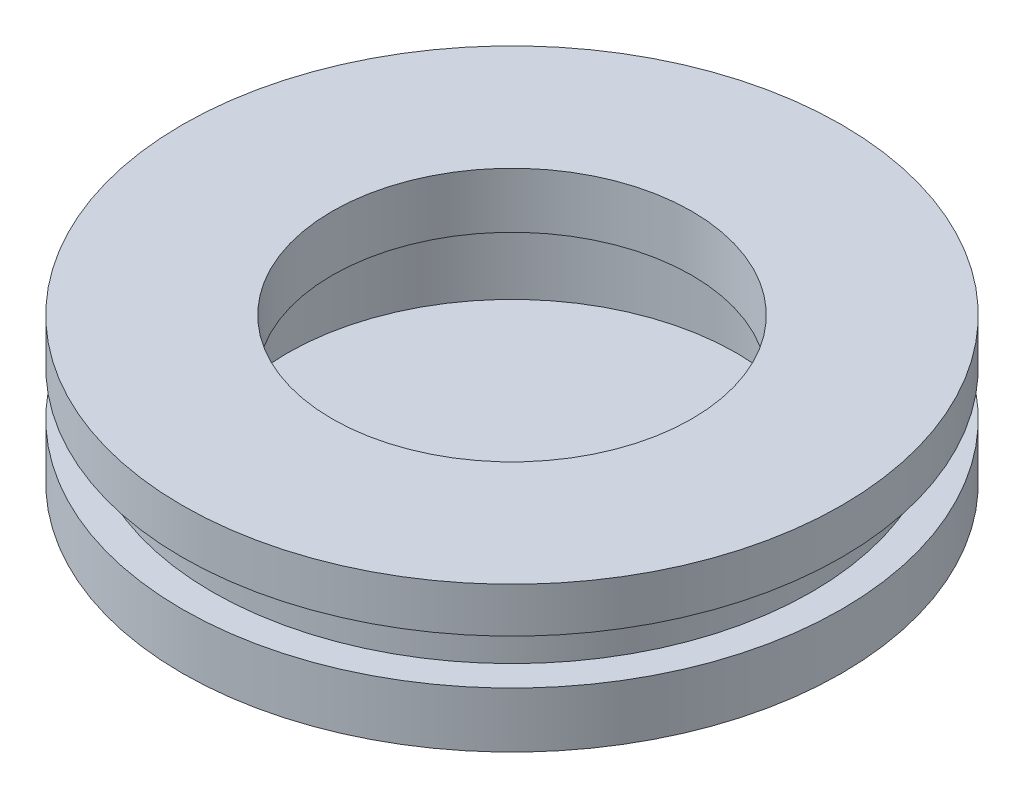
ISO-10303-21;
HEADER;
FILE_DESCRIPTION(('STEP AP214'),'2;1');
FILE_NAME('part.step','',(''),(''),'','','');
FILE_SCHEMA(('AUTOMOTIVE_DESIGN { 1 0 10303 214 1 1 1 1 }'));
ENDSEC;
DATA;
#1=APPLICATION_CONTEXT('core data for automotive mechanical design processes');
#2=APPLICATION_PROTOCOL_DEFINITION('international standard','automotive_design',2000,#1);
#3=PRODUCT_CONTEXT('',#1,'mechanical');
#4=PRODUCT('Part','Part','',(#3));
#5=PRODUCT_RELATED_PRODUCT_CATEGORY('part','',(#4));
#6=PRODUCT_DEFINITION_FORMATION('','',#4);
#7=PRODUCT_DEFINITION_CONTEXT('part definition',#1,'design');
#8=PRODUCT_DEFINITION('design','',#6,#7);
#9=PRODUCT_DEFINITION_SHAPE('','',#8);
#10=(LENGTH_UNIT() NAMED_UNIT(*) SI_UNIT(.MILLI.,.METRE.));
#11=(NAMED_UNIT(*) PLANE_ANGLE_UNIT() SI_UNIT($,.RADIAN.));
#12=(NAMED_UNIT(*) SI_UNIT($,.STERADIAN.) SOLID_ANGLE_UNIT());
#13=UNCERTAINTY_MEASURE_WITH_UNIT(LENGTH_MEASURE(1.E-05),#10,'distance_accuracy_value','');
#14=(GEOMETRIC_REPRESENTATION_CONTEXT(3) GLOBAL_UNCERTAINTY_ASSIGNED_CONTEXT((#13)) GLOBAL_UNIT_ASSIGNED_CONTEXT((#10,
#11,#12)) REPRESENTATION_CONTEXT('',''));
#15=CARTESIAN_POINT('',(0.,0.,0.));
#16=DIRECTION('',(0.,0.,1.));
#17=DIRECTION('',(1.,0.,0.));
#18=AXIS2_PLACEMENT_3D('',#15,#16,#17);
#19=CARTESIAN_POINT('',(0.,0.,0.));
#20=DIRECTION('',(0.,-1.,0.));
#21=DIRECTION('',(0.,0.,-1.));
#22=AXIS2_PLACEMENT_3D('',#19,#20,#21);
#23=CYLINDRICAL_SURFACE('',#22,11.);
#24=CARTESIAN_POINT('',(0.,4.00367257692815,0.));
#25=DIRECTION('',(0.,-1.,0.));
#26=DIRECTION('',(0.,0.,-1.));
#27=AXIS2_PLACEMENT_3D('',#24,#25,#26);
#28=CIRCLE('',#27,11.);
#29=CARTESIAN_POINT('',(0.,4.00367257692815,-11.));
#30=VERTEX_POINT('',#29);
#31=EDGE_CURVE('E53',#30,#30,#28,.T.);
#32=ORIENTED_EDGE('',*,*,#31,.F.);
#33=EDGE_LOOP('',(#32));
#34=FACE_BOUND('',#33,.T.);
#35=CARTESIAN_POINT('',(0.,5.85367257692815,0.));
#36=DIRECTION('',(0.,-1.,0.));
#37=DIRECTION('',(0.,0.,-1.));
#38=AXIS2_PLACEMENT_3D('',#35,#36,#37);
#39=CIRCLE('',#38,11.);
#40=CARTESIAN_POINT('',(0.,5.85367257692815,-11.));
#41=VERTEX_POINT('',#40);
#42=EDGE_CURVE('E11',#41,#41,#39,.T.);
#43=ORIENTED_EDGE('',*,*,#42,.T.);
#44=EDGE_LOOP('',(#43));
#45=FACE_BOUND('',#44,.T.);
#46=ADVANCED_FACE('F35',(#34,#45),#23,.T.);
#47=CARTESIAN_POINT('',(-10.,5.85367257692815,0.));
#48=DIRECTION('',(0.,-1.,0.));
#49=DIRECTION('',(0.,0.,-1.));
#50=AXIS2_PLACEMENT_3D('',#47,#48,#49);
#51=PLANE('',#50);
#52=ORIENTED_EDGE('',*,*,#42,.F.);
#53=EDGE_LOOP('',(#52));
#54=FACE_BOUND('',#53,.T.);
#55=CARTESIAN_POINT('',(0.,5.85367257692815,0.));
#56=DIRECTION('',(0.,-1.,0.));
#57=DIRECTION('',(0.,0.,-1.));
#58=AXIS2_PLACEMENT_3D('',#55,#56,#57);
#59=CIRCLE('',#58,10.);
#60=CARTESIAN_POINT('',(0.,5.85367257692815,-10.));
#61=VERTEX_POINT('',#60);
#62=EDGE_CURVE('E42',#61,#61,#59,.T.);
#63=ORIENTED_EDGE('',*,*,#62,.T.);
#64=EDGE_LOOP('',(#63));
#65=FACE_BOUND('',#64,.T.);
#66=ADVANCED_FACE('F73',(#54,#65),#51,.F.);
#67=CARTESIAN_POINT('',(0.,0.,0.));
#68=DIRECTION('',(0.,-1.,0.));
#69=DIRECTION('',(0.,0.,-1.));
#70=AXIS2_PLACEMENT_3D('',#67,#68,#69);
#71=CYLINDRICAL_SURFACE('',#70,10.);
#72=ORIENTED_EDGE('',*,*,#62,.F.);
#73=EDGE_LOOP('',(#72));
#74=FACE_BOUND('',#73,.T.);
#75=CARTESIAN_POINT('',(0.,7.35367257692815,0.));
#76=DIRECTION('',(0.,-1.,0.));
#77=DIRECTION('',(0.,0.,-1.));
#78=AXIS2_PLACEMENT_3D('',#75,#76,#77);
#79=CIRCLE('',#78,10.);
#80=CARTESIAN_POINT('',(0.,7.35367257692815,-10.));
#81=VERTEX_POINT('',#80);
#82=EDGE_CURVE('E67',#81,#81,#79,.T.);
#83=ORIENTED_EDGE('',*,*,#82,.T.);
#84=EDGE_LOOP('',(#83));
#85=FACE_BOUND('',#84,.T.);
#86=ADVANCED_FACE('F75',(#74,#85),#71,.T.);
#87=CARTESIAN_POINT('',(-11.,7.35367257692815,0.));
#88=DIRECTION('',(0.,1.,0.));
#89=DIRECTION('',(0.,0.,1.));
#90=AXIS2_PLACEMENT_3D('',#87,#88,#89);
#91=PLANE('',#90);
#92=ORIENTED_EDGE('',*,*,#82,.F.);
#93=EDGE_LOOP('',(#92));
#94=FACE_BOUND('',#93,.T.);
#95=CARTESIAN_POINT('',(0.,7.35367257692815,0.));
#96=DIRECTION('',(0.,-1.,0.));
#97=DIRECTION('',(0.,0.,-1.));
#98=AXIS2_PLACEMENT_3D('',#95,#96,#97);
#99=CIRCLE('',#98,11.);
#100=CARTESIAN_POINT('',(0.,7.35367257692815,-11.));
#101=VERTEX_POINT('',#100);
#102=EDGE_CURVE('E58',#101,#101,#99,.T.);
#103=ORIENTED_EDGE('',*,*,#102,.T.);
#104=EDGE_LOOP('',(#103));
#105=FACE_BOUND('',#104,.T.);
#106=ADVANCED_FACE('F78',(#94,#105),#91,.F.);
#107=CARTESIAN_POINT('',(0.,0.,0.));
#108=DIRECTION('',(0.,-1.,0.));
#109=DIRECTION('',(0.,0.,-1.));
#110=AXIS2_PLACEMENT_3D('',#107,#108,#109);
#111=CYLINDRICAL_SURFACE('',#110,11.);
#112=ORIENTED_EDGE('',*,*,#102,.F.);
#113=EDGE_LOOP('',(#112));
#114=FACE_BOUND('',#113,.T.);
#115=CARTESIAN_POINT('',(0.,8.85367257692815,0.));
#116=DIRECTION('',(0.,-1.,0.));
#117=DIRECTION('',(0.,0.,-1.));
#118=AXIS2_PLACEMENT_3D('',#115,#116,#117);
#119=CIRCLE('',#118,11.);
#120=CARTESIAN_POINT('',(0.,8.85367257692815,-11.));
#121=VERTEX_POINT('',#120);
#122=EDGE_CURVE('E55',#121,#121,#119,.T.);
#123=ORIENTED_EDGE('',*,*,#122,.T.);
#124=EDGE_LOOP('',(#123));
#125=FACE_BOUND('',#124,.T.);
#126=ADVANCED_FACE('F84',(#114,#125),#111,.T.);
#127=CARTESIAN_POINT('',(0.,8.85367257692815,0.));
#128=DIRECTION('',(0.,-1.,0.));
#129=DIRECTION('',(0.,0.,-1.));
#130=AXIS2_PLACEMENT_3D('',#127,#128,#129);
#131=PLANE('',#130);
#132=CARTESIAN_POINT('',(0.,8.85367257692815,0.));
#133=DIRECTION('',(0.,-1.,0.));
#134=DIRECTION('',(0.,0.,-1.));
#135=AXIS2_PLACEMENT_3D('',#132,#133,#134);
#136=CIRCLE('',#135,6.);
#137=CARTESIAN_POINT('',(0.,8.85367257692815,-6.));
#138=VERTEX_POINT('',#137);
#139=EDGE_CURVE('E38',#138,#138,#136,.F.);
#140=ORIENTED_EDGE('',*,*,#139,.F.);
#141=EDGE_LOOP('',(#140));
#142=FACE_BOUND('',#141,.T.);
#143=ORIENTED_EDGE('',*,*,#122,.F.);
#144=EDGE_LOOP('',(#143));
#145=FACE_BOUND('',#144,.T.);
#146=ADVANCED_FACE('F49',(#142,#145),#131,.F.);
#147=CARTESIAN_POINT('',(0.,4.00367257692815,0.));
#148=DIRECTION('',(0.,1.,0.));
#149=DIRECTION('',(0.,0.,1.));
#150=AXIS2_PLACEMENT_3D('',#147,#148,#149);
#151=CONICAL_SURFACE('',#150,11.,1.22173047639604);
#152=CARTESIAN_POINT('',(0.,0.,0.));
#153=VERTEX_POINT('',#152);
#154=VERTEX_LOOP('',#153);
#155=FACE_BOUND('',#154,.T.);
#156=ORIENTED_EDGE('',*,*,#31,.T.);
#157=EDGE_LOOP('',(#156));
#158=FACE_BOUND('',#157,.T.);
#159=ADVANCED_FACE('F45',(#155,#158),#151,.T.);
#160=CARTESIAN_POINT('',(0.,4.00367257692815,0.));
#161=DIRECTION('',(0.,-1.,0.));
#162=DIRECTION('',(0.,0.,-1.));
#163=AXIS2_PLACEMENT_3D('',#160,#161,#162);
#164=CYLINDRICAL_SURFACE('',#163,6.);
#165=CARTESIAN_POINT('',(0.,7.00367257692815,0.));
#166=DIRECTION('',(0.,-1.,0.));
#167=DIRECTION('',(0.,0.,-1.));
#168=AXIS2_PLACEMENT_3D('',#165,#166,#167);
#169=CIRCLE('',#168,6.);
#170=CARTESIAN_POINT('',(0.,7.00367257692815,-6.));
#171=VERTEX_POINT('',#170);
#172=EDGE_CURVE('E179',#171,#171,#169,.T.);
#173=ORIENTED_EDGE('',*,*,#172,.T.);
#174=EDGE_LOOP('',(#173));
#175=FACE_BOUND('',#174,.T.);
#176=ORIENTED_EDGE('',*,*,#139,.T.);
#177=EDGE_LOOP('',(#176));
#178=FACE_BOUND('',#177,.T.);
#179=ADVANCED_FACE('F48',(#175,#178),#164,.F.);
#180=CARTESIAN_POINT('',(0.,4.00367257692815,0.));
#181=DIRECTION('',(0.,-1.,0.));
#182=DIRECTION('',(0.,0.,-1.));
#183=AXIS2_PLACEMENT_3D('',#180,#181,#182);
#184=CYLINDRICAL_SURFACE('',#183,7.5);
#185=CARTESIAN_POINT('',(0.,4.00367257692815,0.));
#186=DIRECTION('',(0.,-1.,0.));
#187=DIRECTION('',(0.,0.,-1.));
#188=AXIS2_PLACEMENT_3D('',#185,#186,#187);
#189=CIRCLE('',#188,7.5);
#190=CARTESIAN_POINT('',(0.,4.00367257692815,-7.5));
#191=VERTEX_POINT('',#190);
#192=EDGE_CURVE('E61',#191,#191,#189,.T.);
#193=ORIENTED_EDGE('',*,*,#192,.T.);
#194=EDGE_LOOP('',(#193));
#195=FACE_BOUND('',#194,.T.);
#196=CARTESIAN_POINT('',(0.,7.00367257692815,0.));
#197=DIRECTION('',(0.,-1.,0.));
#198=DIRECTION('',(0.,0.,-1.));
#199=AXIS2_PLACEMENT_3D('',#196,#197,#198);
#200=CIRCLE('',#199,7.5);
#201=CARTESIAN_POINT('',(0.,7.00367257692815,-7.5));
#202=VERTEX_POINT('',#201);
#203=EDGE_CURVE('E176',#202,#202,#200,.T.);
#204=ORIENTED_EDGE('',*,*,#203,.F.);
#205=EDGE_LOOP('',(#204));
#206=FACE_BOUND('',#205,.T.);
#207=ADVANCED_FACE('F139',(#195,#206),#184,.F.);
#208=CARTESIAN_POINT('',(0.,4.00367257692815,0.));
#209=DIRECTION('',(0.,1.,0.));
#210=DIRECTION('',(0.,0.,1.));
#211=AXIS2_PLACEMENT_3D('',#208,#209,#210);
#212=PLANE('',#211);
#213=ORIENTED_EDGE('',*,*,#192,.F.);
#214=EDGE_LOOP('',(#213));
#215=FACE_BOUND('',#214,.T.);
#216=ADVANCED_FACE('F149',(#215),#212,.T.);
#217=CARTESIAN_POINT('',(0.,7.00367257692815,0.));
#218=DIRECTION('',(0.,-1.,0.));
#219=DIRECTION('',(0.,0.,-1.));
#220=AXIS2_PLACEMENT_3D('',#217,#218,#219);
#221=PLANE('',#220);
#222=ORIENTED_EDGE('',*,*,#203,.T.);
#223=EDGE_LOOP('',(#222));
#224=FACE_BOUND('',#223,.T.);
#225=ORIENTED_EDGE('',*,*,#172,.F.);
#226=EDGE_LOOP('',(#225));
#227=FACE_BOUND('',#226,.T.);
#228=ADVANCED_FACE('F159',(#224,#227),#221,.T.);
#229=CLOSED_SHELL('',(#46,#66,#86,#106,#126,#146,#159,#179,#207,#216,#228));
#230=MANIFOLD_SOLID_BREP('B2',#229);
#231=ADVANCED_BREP_SHAPE_REPRESENTATION('',(#18,#230),#14);
#232=SHAPE_DEFINITION_REPRESENTATION(#9,#231);
ENDSEC;
END-ISO-10303-21;
